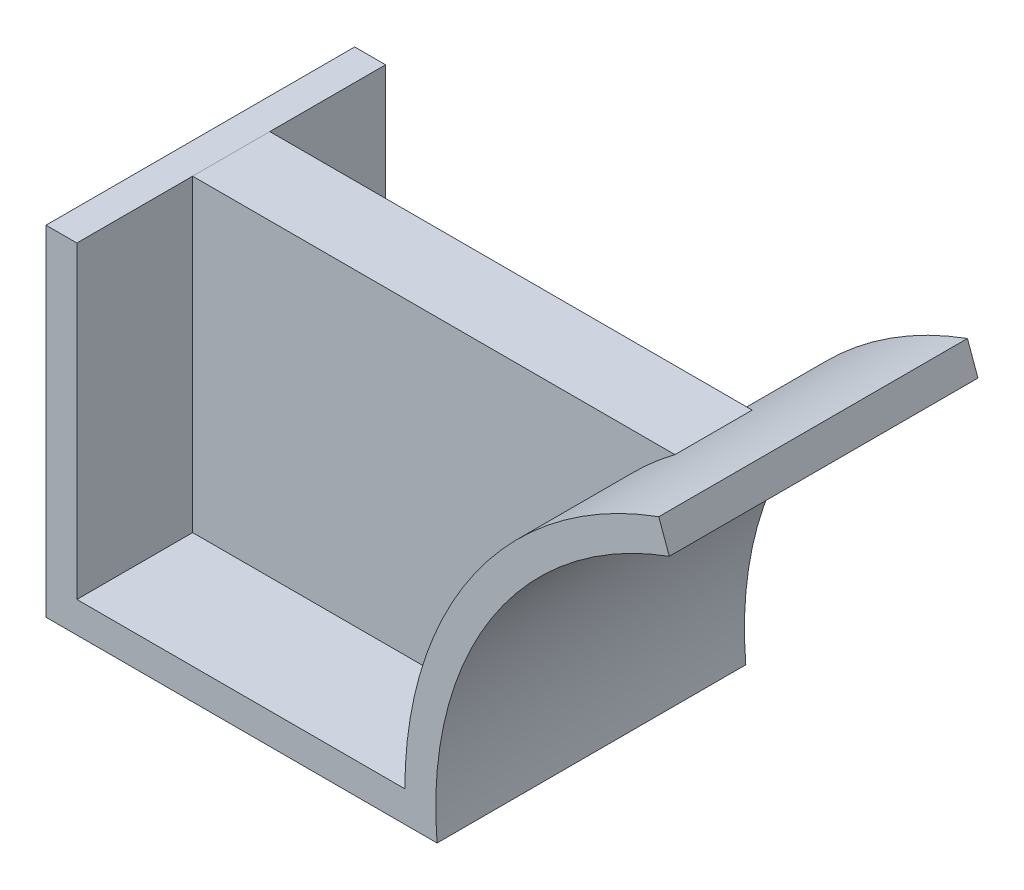
ISO-10303-21;
HEADER;
FILE_DESCRIPTION(('STEP AP214'),'2;1');
FILE_NAME('part.step','',(''),(''),'','','');
FILE_SCHEMA(('AUTOMOTIVE_DESIGN { 1 0 10303 214 1 1 1 1 }'));
ENDSEC;
DATA;
#1=APPLICATION_CONTEXT('core data for automotive mechanical design processes');
#2=APPLICATION_PROTOCOL_DEFINITION('international standard','automotive_design',2000,#1);
#3=PRODUCT_CONTEXT('',#1,'mechanical');
#4=PRODUCT('Part','Part','',(#3));
#5=PRODUCT_RELATED_PRODUCT_CATEGORY('part','',(#4));
#6=PRODUCT_DEFINITION_FORMATION('','',#4);
#7=PRODUCT_DEFINITION_CONTEXT('part definition',#1,'design');
#8=PRODUCT_DEFINITION('design','',#6,#7);
#9=PRODUCT_DEFINITION_SHAPE('','',#8);
#10=(LENGTH_UNIT() NAMED_UNIT(*) SI_UNIT(.MILLI.,.METRE.));
#11=(NAMED_UNIT(*) PLANE_ANGLE_UNIT() SI_UNIT($,.RADIAN.));
#12=(NAMED_UNIT(*) SI_UNIT($,.STERADIAN.) SOLID_ANGLE_UNIT());
#13=UNCERTAINTY_MEASURE_WITH_UNIT(LENGTH_MEASURE(1.E-05),#10,'distance_accuracy_value','');
#14=(GEOMETRIC_REPRESENTATION_CONTEXT(3) GLOBAL_UNCERTAINTY_ASSIGNED_CONTEXT((#13)) GLOBAL_UNIT_ASSIGNED_CONTEXT((#10,
#11,#12)) REPRESENTATION_CONTEXT('',''));
#15=CARTESIAN_POINT('',(0.,0.,0.));
#16=DIRECTION('',(0.,0.,1.));
#17=DIRECTION('',(1.,0.,0.));
#18=AXIS2_PLACEMENT_3D('',#15,#16,#17);
#19=CARTESIAN_POINT('',(185.,0.,80.));
#20=DIRECTION('',(0.,0.,-1.));
#21=DIRECTION('',(-1.,0.,0.));
#22=AXIS2_PLACEMENT_3D('',#19,#20,#21);
#23=CYLINDRICAL_SURFACE('',#22,100.);
#24=DIRECTION('',(0.,0.,-1.));
#25=VECTOR('',#24,1.);
#26=CARTESIAN_POINT('',(85.,0.,80.));
#27=LINE('',#26,#25);
#28=CARTESIAN_POINT('',(85.,0.,30.));
#29=VERTEX_POINT('',#28);
#30=CARTESIAN_POINT('',(85.,0.,50.));
#31=VERTEX_POINT('',#30);
#32=EDGE_CURVE('E50',#29,#31,#27,.F.);
#33=ORIENTED_EDGE('',*,*,#32,.F.);
#34=CARTESIAN_POINT('',(185.,0.,30.));
#35=DIRECTION('',(0.,0.,1.));
#36=DIRECTION('',(1.,0.,0.));
#37=AXIS2_PLACEMENT_3D('',#34,#35,#36);
#38=CIRCLE('',#37,100.);
#39=CARTESIAN_POINT('',(125.,80.,30.));
#40=VERTEX_POINT('',#39);
#41=EDGE_CURVE('E63',#40,#29,#38,.T.);
#42=ORIENTED_EDGE('',*,*,#41,.F.);
#43=DIRECTION('',(0.,0.,-1.));
#44=VECTOR('',#43,1.);
#45=CARTESIAN_POINT('',(125.,80.,80.));
#46=LINE('',#45,#44);
#47=CARTESIAN_POINT('',(125.,80.,50.));
#48=VERTEX_POINT('',#47);
#49=EDGE_CURVE('E90',#48,#40,#46,.T.);
#50=ORIENTED_EDGE('',*,*,#49,.F.);
#51=CARTESIAN_POINT('',(185.,0.,50.));
#52=DIRECTION('',(0.,0.,-1.));
#53=DIRECTION('',(-1.,0.,0.));
#54=AXIS2_PLACEMENT_3D('',#51,#52,#53);
#55=CIRCLE('',#54,100.);
#56=EDGE_CURVE('E12',#31,#48,#55,.T.);
#57=ORIENTED_EDGE('',*,*,#56,.F.);
#58=EDGE_LOOP('',(#33,#42,#50,#57));
#59=FACE_BOUND('',#58,.T.);
#60=ADVANCED_FACE('F43',(#59),#23,.F.);
#61=CARTESIAN_POINT('',(0.,0.,0.));
#62=DIRECTION('',(-1.,0.,0.));
#63=DIRECTION('',(0.,0.,1.));
#64=AXIS2_PLACEMENT_3D('',#61,#62,#63);
#65=PLANE('',#64);
#66=DIRECTION('',(0.,-1.,0.));
#67=VECTOR('',#66,1.);
#68=CARTESIAN_POINT('',(0.,0.,50.));
#69=LINE('',#68,#67);
#70=CARTESIAN_POINT('',(0.,80.,50.));
#71=VERTEX_POINT('',#70);
#72=CARTESIAN_POINT('',(0.,0.,50.));
#73=VERTEX_POINT('',#72);
#74=EDGE_CURVE('E97',#71,#73,#69,.T.);
#75=ORIENTED_EDGE('',*,*,#74,.F.);
#76=DIRECTION('',(0.,0.,1.));
#77=VECTOR('',#76,1.);
#78=CARTESIAN_POINT('',(0.,80.,50.));
#79=LINE('',#78,#77);
#80=CARTESIAN_POINT('',(0.,80.,30.));
#81=VERTEX_POINT('',#80);
#82=EDGE_CURVE('E105',#81,#71,#79,.T.);
#83=ORIENTED_EDGE('',*,*,#82,.F.);
#84=DIRECTION('',(0.,1.,0.));
#85=VECTOR('',#84,1.);
#86=CARTESIAN_POINT('',(0.,0.,30.));
#87=LINE('',#86,#85);
#88=CARTESIAN_POINT('',(0.,0.,30.));
#89=VERTEX_POINT('',#88);
#90=EDGE_CURVE('E99',#89,#81,#87,.T.);
#91=ORIENTED_EDGE('',*,*,#90,.F.);
#92=DIRECTION('',(0.,0.,-1.));
#93=VECTOR('',#92,1.);
#94=CARTESIAN_POINT('',(0.,0.,50.));
#95=LINE('',#94,#93);
#96=EDGE_CURVE('E86',#73,#89,#95,.T.);
#97=ORIENTED_EDGE('',*,*,#96,.F.);
#98=EDGE_LOOP('',(#75,#83,#91,#97));
#99=FACE_BOUND('',#98,.T.);
#100=ADVANCED_FACE('F95',(#99),#65,.T.);
#101=CARTESIAN_POINT('',(153.536146814038,0.,50.));
#102=DIRECTION('',(0.,1.,0.));
#103=DIRECTION('',(0.,0.,1.));
#104=AXIS2_PLACEMENT_3D('',#101,#102,#103);
#105=PLANE('',#104);
#106=DIRECTION('',(-1.,0.,0.));
#107=VECTOR('',#106,1.);
#108=CARTESIAN_POINT('',(153.536146814038,0.,30.));
#109=LINE('',#108,#107);
#110=EDGE_CURVE('E91',#29,#89,#109,.T.);
#111=ORIENTED_EDGE('',*,*,#110,.F.);
#112=ORIENTED_EDGE('',*,*,#32,.T.);
#113=DIRECTION('',(-1.,0.,0.));
#114=VECTOR('',#113,1.);
#115=CARTESIAN_POINT('',(153.536146814038,0.,50.));
#116=LINE('',#115,#114);
#117=EDGE_CURVE('E82',#31,#73,#116,.T.);
#118=ORIENTED_EDGE('',*,*,#117,.T.);
#119=ORIENTED_EDGE('',*,*,#96,.T.);
#120=EDGE_LOOP('',(#111,#112,#118,#119));
#121=FACE_BOUND('',#120,.T.);
#122=ADVANCED_FACE('F85',(#121),#105,.F.);
#123=CARTESIAN_POINT('',(153.536146814038,0.,30.));
#124=DIRECTION('',(0.,0.,1.));
#125=DIRECTION('',(1.,0.,0.));
#126=AXIS2_PLACEMENT_3D('',#123,#124,#125);
#127=PLANE('',#126);
#128=DIRECTION('',(-1.,0.,0.));
#129=VECTOR('',#128,1.);
#130=CARTESIAN_POINT('',(153.536146814038,80.,30.));
#131=LINE('',#130,#129);
#132=EDGE_CURVE('E111',#40,#81,#131,.T.);
#133=ORIENTED_EDGE('',*,*,#132,.F.);
#134=ORIENTED_EDGE('',*,*,#41,.T.);
#135=ORIENTED_EDGE('',*,*,#110,.T.);
#136=ORIENTED_EDGE('',*,*,#90,.T.);
#137=EDGE_LOOP('',(#133,#134,#135,#136));
#138=FACE_BOUND('',#137,.T.);
#139=ADVANCED_FACE('F117',(#138),#127,.F.);
#140=CARTESIAN_POINT('',(153.536146814038,0.,50.));
#141=DIRECTION('',(0.,0.,-1.));
#142=DIRECTION('',(-1.,0.,0.));
#143=AXIS2_PLACEMENT_3D('',#140,#141,#142);
#144=PLANE('',#143);
#145=ORIENTED_EDGE('',*,*,#117,.F.);
#146=ORIENTED_EDGE('',*,*,#56,.T.);
#147=DIRECTION('',(-1.,0.,0.));
#148=VECTOR('',#147,1.);
#149=CARTESIAN_POINT('',(153.536146814038,80.,50.));
#150=LINE('',#149,#148);
#151=EDGE_CURVE('E100',#48,#71,#150,.T.);
#152=ORIENTED_EDGE('',*,*,#151,.T.);
#153=ORIENTED_EDGE('',*,*,#74,.T.);
#154=EDGE_LOOP('',(#145,#146,#152,#153));
#155=FACE_BOUND('',#154,.T.);
#156=ADVANCED_FACE('F102',(#155),#144,.F.);
#157=CARTESIAN_POINT('',(153.536146814038,80.,50.));
#158=DIRECTION('',(0.,-1.,0.));
#159=DIRECTION('',(0.,0.,-1.));
#160=AXIS2_PLACEMENT_3D('',#157,#158,#159);
#161=PLANE('',#160);
#162=ORIENTED_EDGE('',*,*,#151,.F.);
#163=ORIENTED_EDGE('',*,*,#49,.T.);
#164=ORIENTED_EDGE('',*,*,#132,.T.);
#165=ORIENTED_EDGE('',*,*,#82,.T.);
#166=EDGE_LOOP('',(#162,#163,#164,#165));
#167=FACE_BOUND('',#166,.T.);
#168=ADVANCED_FACE('F116',(#167),#161,.F.);
#169=CLOSED_SHELL('',(#60,#100,#122,#139,#156,#168));
#170=MANIFOLD_SOLID_BREP('B2',#169);
#171=CARTESIAN_POINT('',(185.,0.,80.));
#172=DIRECTION('',(0.,0.,-1.));
#173=DIRECTION('',(-1.,0.,0.));
#174=AXIS2_PLACEMENT_3D('',#171,#172,#173);
#175=CYLINDRICAL_SURFACE('',#174,92.);
#176=CARTESIAN_POINT('',(185.,0.,0.));
#177=DIRECTION('',(0.,0.,1.));
#178=DIRECTION('',(1.,0.,0.));
#179=AXIS2_PLACEMENT_3D('',#176,#177,#178);
#180=CIRCLE('',#179,92.);
#181=CARTESIAN_POINT('',(93.3484861008832,-8.,0.));
#182=VERTEX_POINT('',#181);
#183=CARTESIAN_POINT('',(153.534146814038,86.4517211123034,0.));
#184=VERTEX_POINT('',#183);
#185=EDGE_CURVE('E264',#182,#184,#180,.F.);
#186=ORIENTED_EDGE('',*,*,#185,.T.);
#187=DIRECTION('',(0.,0.,-1.));
#188=VECTOR('',#187,1.);
#189=CARTESIAN_POINT('',(153.534146814038,86.4517211123034,80.));
#190=LINE('',#189,#188);
#191=CARTESIAN_POINT('',(153.534146814038,86.4517211123034,80.));
#192=VERTEX_POINT('',#191);
#193=EDGE_CURVE('E41',#192,#184,#190,.T.);
#194=ORIENTED_EDGE('',*,*,#193,.F.);
#195=CARTESIAN_POINT('',(185.,0.,80.));
#196=DIRECTION('',(0.,0.,1.));
#197=DIRECTION('',(1.,0.,0.));
#198=AXIS2_PLACEMENT_3D('',#195,#196,#197);
#199=CIRCLE('',#198,92.);
#200=CARTESIAN_POINT('',(93.3484861008832,-8.,80.));
#201=VERTEX_POINT('',#200);
#202=EDGE_CURVE('E222',#201,#192,#199,.F.);
#203=ORIENTED_EDGE('',*,*,#202,.F.);
#204=DIRECTION('',(0.,0.,-1.));
#205=VECTOR('',#204,1.);
#206=CARTESIAN_POINT('',(93.3484861008832,-8.,80.));
#207=LINE('',#206,#205);
#208=EDGE_CURVE('E263',#201,#182,#207,.T.);
#209=ORIENTED_EDGE('',*,*,#208,.T.);
#210=EDGE_LOOP('',(#186,#194,#203,#209));
#211=FACE_BOUND('',#210,.T.);
#212=ADVANCED_FACE('F167',(#211),#175,.F.);
#213=CARTESIAN_POINT('',(150.797985667433,93.9692620785907,80.));
#214=DIRECTION('',(0.939692620785907,0.342020143325673,0.));
#215=DIRECTION('',(-0.342020143325673,0.939692620785907,0.));
#216=AXIS2_PLACEMENT_3D('',#213,#214,#215);
#217=PLANE('',#216);
#218=DIRECTION('',(0.342020143325673,-0.939692620785907,0.));
#219=VECTOR('',#218,1.);
#220=CARTESIAN_POINT('',(150.797985667433,93.9692620785907,0.));
#221=LINE('',#220,#219);
#222=CARTESIAN_POINT('',(150.797985667433,93.9692620785907,0.));
#223=VERTEX_POINT('',#222);
#224=EDGE_CURVE('E267',#223,#184,#221,.T.);
#225=ORIENTED_EDGE('',*,*,#224,.F.);
#226=DIRECTION('',(0.,0.,-1.));
#227=VECTOR('',#226,1.);
#228=CARTESIAN_POINT('',(150.797985667433,93.9692620785907,80.));
#229=LINE('',#228,#227);
#230=CARTESIAN_POINT('',(150.797985667433,93.9692620785907,80.));
#231=VERTEX_POINT('',#230);
#232=EDGE_CURVE('E175',#231,#223,#229,.T.);
#233=ORIENTED_EDGE('',*,*,#232,.F.);
#234=DIRECTION('',(0.342020143325673,-0.939692620785907,0.));
#235=VECTOR('',#234,1.);
#236=CARTESIAN_POINT('',(150.797985667433,93.9692620785907,80.));
#237=LINE('',#236,#235);
#238=EDGE_CURVE('E306',#231,#192,#237,.T.);
#239=ORIENTED_EDGE('',*,*,#238,.T.);
#240=ORIENTED_EDGE('',*,*,#193,.T.);
#241=EDGE_LOOP('',(#225,#233,#239,#240));
#242=FACE_BOUND('',#241,.T.);
#243=ADVANCED_FACE('F297',(#242),#217,.T.);
#244=CARTESIAN_POINT('',(185.,0.,80.));
#245=DIRECTION('',(0.,0.,-1.));
#246=DIRECTION('',(-1.,0.,0.));
#247=AXIS2_PLACEMENT_3D('',#244,#245,#246);
#248=CYLINDRICAL_SURFACE('',#247,100.);
#249=CARTESIAN_POINT('',(185.,0.,0.));
#250=DIRECTION('',(0.,0.,-1.));
#251=DIRECTION('',(-1.,0.,0.));
#252=AXIS2_PLACEMENT_3D('',#249,#250,#251);
#253=CIRCLE('',#252,100.);
#254=CARTESIAN_POINT('',(85.,0.,0.));
#255=VERTEX_POINT('',#254);
#256=EDGE_CURVE('E270',#255,#223,#253,.T.);
#257=ORIENTED_EDGE('',*,*,#256,.F.);
#258=DIRECTION('',(0.,0.,-1.));
#259=VECTOR('',#258,1.);
#260=CARTESIAN_POINT('',(85.,0.,80.));
#261=LINE('',#260,#259);
#262=CARTESIAN_POINT('',(85.,0.,80.));
#263=VERTEX_POINT('',#262);
#264=EDGE_CURVE('E287',#263,#255,#261,.T.);
#265=ORIENTED_EDGE('',*,*,#264,.F.);
#266=CARTESIAN_POINT('',(185.,0.,80.));
#267=DIRECTION('',(0.,0.,-1.));
#268=DIRECTION('',(-1.,0.,0.));
#269=AXIS2_PLACEMENT_3D('',#266,#267,#268);
#270=CIRCLE('',#269,100.);
#271=EDGE_CURVE('E294',#263,#231,#270,.T.);
#272=ORIENTED_EDGE('',*,*,#271,.T.);
#273=ORIENTED_EDGE('',*,*,#232,.T.);
#274=EDGE_LOOP('',(#257,#265,#272,#273));
#275=FACE_BOUND('',#274,.T.);
#276=ADVANCED_FACE('F292',(#275),#248,.T.);
#277=CARTESIAN_POINT('',(0.,0.,80.));
#278=DIRECTION('',(0.,1.,0.));
#279=DIRECTION('',(0.,0.,1.));
#280=AXIS2_PLACEMENT_3D('',#277,#278,#279);
#281=PLANE('',#280);
#282=DIRECTION('',(1.,0.,0.));
#283=VECTOR('',#282,1.);
#284=CARTESIAN_POINT('',(0.,0.,0.));
#285=LINE('',#284,#283);
#286=CARTESIAN_POINT('',(0.,0.,0.));
#287=VERTEX_POINT('',#286);
#288=EDGE_CURVE('E273',#287,#255,#285,.T.);
#289=ORIENTED_EDGE('',*,*,#288,.F.);
#290=DIRECTION('',(0.,0.,-1.));
#291=VECTOR('',#290,1.);
#292=CARTESIAN_POINT('',(0.,0.,80.));
#293=LINE('',#292,#291);
#294=CARTESIAN_POINT('',(0.,0.,80.));
#295=VERTEX_POINT('',#294);
#296=EDGE_CURVE('E285',#295,#287,#293,.T.);
#297=ORIENTED_EDGE('',*,*,#296,.F.);
#298=DIRECTION('',(1.,0.,0.));
#299=VECTOR('',#298,1.);
#300=CARTESIAN_POINT('',(0.,0.,80.));
#301=LINE('',#300,#299);
#302=EDGE_CURVE('E258',#295,#263,#301,.T.);
#303=ORIENTED_EDGE('',*,*,#302,.T.);
#304=ORIENTED_EDGE('',*,*,#264,.T.);
#305=EDGE_LOOP('',(#289,#297,#303,#304));
#306=FACE_BOUND('',#305,.T.);
#307=ADVANCED_FACE('F304',(#306),#281,.T.);
#308=CARTESIAN_POINT('',(0.,0.,80.));
#309=DIRECTION('',(1.,0.,0.));
#310=DIRECTION('',(0.,0.,-1.));
#311=AXIS2_PLACEMENT_3D('',#308,#309,#310);
#312=PLANE('',#311);
#313=DIRECTION('',(0.,-1.,0.));
#314=VECTOR('',#313,1.);
#315=CARTESIAN_POINT('',(0.,0.,0.));
#316=LINE('',#315,#314);
#317=CARTESIAN_POINT('',(0.,80.,0.));
#318=VERTEX_POINT('',#317);
#319=EDGE_CURVE('E276',#318,#287,#316,.T.);
#320=ORIENTED_EDGE('',*,*,#319,.F.);
#321=DIRECTION('',(0.,0.,-1.));
#322=VECTOR('',#321,1.);
#323=CARTESIAN_POINT('',(0.,80.,80.));
#324=LINE('',#323,#322);
#325=CARTESIAN_POINT('',(0.,80.,80.));
#326=VERTEX_POINT('',#325);
#327=EDGE_CURVE('E246',#326,#318,#324,.T.);
#328=ORIENTED_EDGE('',*,*,#327,.F.);
#329=DIRECTION('',(0.,-1.,0.));
#330=VECTOR('',#329,1.);
#331=CARTESIAN_POINT('',(0.,0.,80.));
#332=LINE('',#331,#330);
#333=EDGE_CURVE('E256',#326,#295,#332,.T.);
#334=ORIENTED_EDGE('',*,*,#333,.T.);
#335=ORIENTED_EDGE('',*,*,#296,.T.);
#336=EDGE_LOOP('',(#320,#328,#334,#335));
#337=FACE_BOUND('',#336,.T.);
#338=ADVANCED_FACE('F311',(#337),#312,.T.);
#339=CARTESIAN_POINT('',(-8.,80.,80.));
#340=DIRECTION('',(0.,1.,0.));
#341=DIRECTION('',(0.,0.,1.));
#342=AXIS2_PLACEMENT_3D('',#339,#340,#341);
#343=PLANE('',#342);
#344=DIRECTION('',(1.,0.,0.));
#345=VECTOR('',#344,1.);
#346=CARTESIAN_POINT('',(-8.,80.,0.));
#347=LINE('',#346,#345);
#348=CARTESIAN_POINT('',(-8.,80.,0.));
#349=VERTEX_POINT('',#348);
#350=EDGE_CURVE('E245',#349,#318,#347,.T.);
#351=ORIENTED_EDGE('',*,*,#350,.F.);
#352=DIRECTION('',(0.,0.,-1.));
#353=VECTOR('',#352,1.);
#354=CARTESIAN_POINT('',(-8.,80.,80.));
#355=LINE('',#354,#353);
#356=CARTESIAN_POINT('',(-8.,80.,80.));
#357=VERTEX_POINT('',#356);
#358=EDGE_CURVE('E239',#357,#349,#355,.T.);
#359=ORIENTED_EDGE('',*,*,#358,.F.);
#360=DIRECTION('',(1.,0.,0.));
#361=VECTOR('',#360,1.);
#362=CARTESIAN_POINT('',(-8.,80.,80.));
#363=LINE('',#362,#361);
#364=EDGE_CURVE('E243',#357,#326,#363,.T.);
#365=ORIENTED_EDGE('',*,*,#364,.T.);
#366=ORIENTED_EDGE('',*,*,#327,.T.);
#367=EDGE_LOOP('',(#351,#359,#365,#366));
#368=FACE_BOUND('',#367,.T.);
#369=ADVANCED_FACE('F241',(#368),#343,.T.);
#370=CARTESIAN_POINT('',(-8.,0.,80.));
#371=DIRECTION('',(1.,0.,0.));
#372=DIRECTION('',(0.,0.,-1.));
#373=AXIS2_PLACEMENT_3D('',#370,#371,#372);
#374=PLANE('',#373);
#375=DIRECTION('',(0.,1.,0.));
#376=VECTOR('',#375,1.);
#377=CARTESIAN_POINT('',(-8.,0.,0.));
#378=LINE('',#377,#376);
#379=CARTESIAN_POINT('',(-8.,-8.,0.));
#380=VERTEX_POINT('',#379);
#381=EDGE_CURVE('E210',#349,#380,#378,.F.);
#382=ORIENTED_EDGE('',*,*,#381,.T.);
#383=DIRECTION('',(0.,0.,-1.));
#384=VECTOR('',#383,1.);
#385=CARTESIAN_POINT('',(-8.,-8.,80.));
#386=LINE('',#385,#384);
#387=CARTESIAN_POINT('',(-8.,-8.,80.));
#388=VERTEX_POINT('',#387);
#389=EDGE_CURVE('E247',#388,#380,#386,.T.);
#390=ORIENTED_EDGE('',*,*,#389,.F.);
#391=DIRECTION('',(0.,1.,0.));
#392=VECTOR('',#391,1.);
#393=CARTESIAN_POINT('',(-8.,0.,80.));
#394=LINE('',#393,#392);
#395=EDGE_CURVE('E249',#357,#388,#394,.F.);
#396=ORIENTED_EDGE('',*,*,#395,.F.);
#397=ORIENTED_EDGE('',*,*,#358,.T.);
#398=EDGE_LOOP('',(#382,#390,#396,#397));
#399=FACE_BOUND('',#398,.T.);
#400=ADVANCED_FACE('F250',(#399),#374,.F.);
#401=CARTESIAN_POINT('',(0.,-8.,80.));
#402=DIRECTION('',(0.,1.,0.));
#403=DIRECTION('',(0.,0.,1.));
#404=AXIS2_PLACEMENT_3D('',#401,#402,#403);
#405=PLANE('',#404);
#406=DIRECTION('',(1.,0.,0.));
#407=VECTOR('',#406,1.);
#408=CARTESIAN_POINT('',(0.,-8.,0.));
#409=LINE('',#408,#407);
#410=EDGE_CURVE('E216',#380,#182,#409,.T.);
#411=ORIENTED_EDGE('',*,*,#410,.T.);
#412=ORIENTED_EDGE('',*,*,#208,.F.);
#413=DIRECTION('',(1.,0.,0.));
#414=VECTOR('',#413,1.);
#415=CARTESIAN_POINT('',(0.,-8.,80.));
#416=LINE('',#415,#414);
#417=EDGE_CURVE('E183',#388,#201,#416,.T.);
#418=ORIENTED_EDGE('',*,*,#417,.F.);
#419=ORIENTED_EDGE('',*,*,#389,.T.);
#420=EDGE_LOOP('',(#411,#412,#418,#419));
#421=FACE_BOUND('',#420,.T.);
#422=ADVANCED_FACE('F313',(#421),#405,.F.);
#423=CARTESIAN_POINT('',(185.,0.,80.));
#424=DIRECTION('',(0.,0.,1.));
#425=DIRECTION('',(1.,0.,0.));
#426=AXIS2_PLACEMENT_3D('',#423,#424,#425);
#427=PLANE('',#426);
#428=ORIENTED_EDGE('',*,*,#202,.T.);
#429=ORIENTED_EDGE('',*,*,#238,.F.);
#430=ORIENTED_EDGE('',*,*,#271,.F.);
#431=ORIENTED_EDGE('',*,*,#302,.F.);
#432=ORIENTED_EDGE('',*,*,#333,.F.);
#433=ORIENTED_EDGE('',*,*,#364,.F.);
#434=ORIENTED_EDGE('',*,*,#395,.T.);
#435=ORIENTED_EDGE('',*,*,#417,.T.);
#436=EDGE_LOOP('',(#428,#429,#430,#431,#432,#433,#434,#435));
#437=FACE_BOUND('',#436,.T.);
#438=ADVANCED_FACE('F253',(#437),#427,.T.);
#439=CARTESIAN_POINT('',(185.,0.,0.));
#440=DIRECTION('',(0.,0.,1.));
#441=DIRECTION('',(1.,0.,0.));
#442=AXIS2_PLACEMENT_3D('',#439,#440,#441);
#443=PLANE('',#442);
#444=ORIENTED_EDGE('',*,*,#185,.F.);
#445=ORIENTED_EDGE('',*,*,#410,.F.);
#446=ORIENTED_EDGE('',*,*,#381,.F.);
#447=ORIENTED_EDGE('',*,*,#350,.T.);
#448=ORIENTED_EDGE('',*,*,#319,.T.);
#449=ORIENTED_EDGE('',*,*,#288,.T.);
#450=ORIENTED_EDGE('',*,*,#256,.T.);
#451=ORIENTED_EDGE('',*,*,#224,.T.);
#452=EDGE_LOOP('',(#444,#445,#446,#447,#448,#449,#450,#451));
#453=FACE_BOUND('',#452,.T.);
#454=ADVANCED_FACE('F300',(#453),#443,.F.);
#455=CLOSED_SHELL('',(#212,#243,#276,#307,#338,#369,#400,#422,#438,#454));
#456=MANIFOLD_SOLID_BREP('B6',#455);
#457=ADVANCED_BREP_SHAPE_REPRESENTATION('',(#18,#170,#456),#14);
#458=SHAPE_DEFINITION_REPRESENTATION(#9,#457);
ENDSEC;
END-ISO-10303-21;
